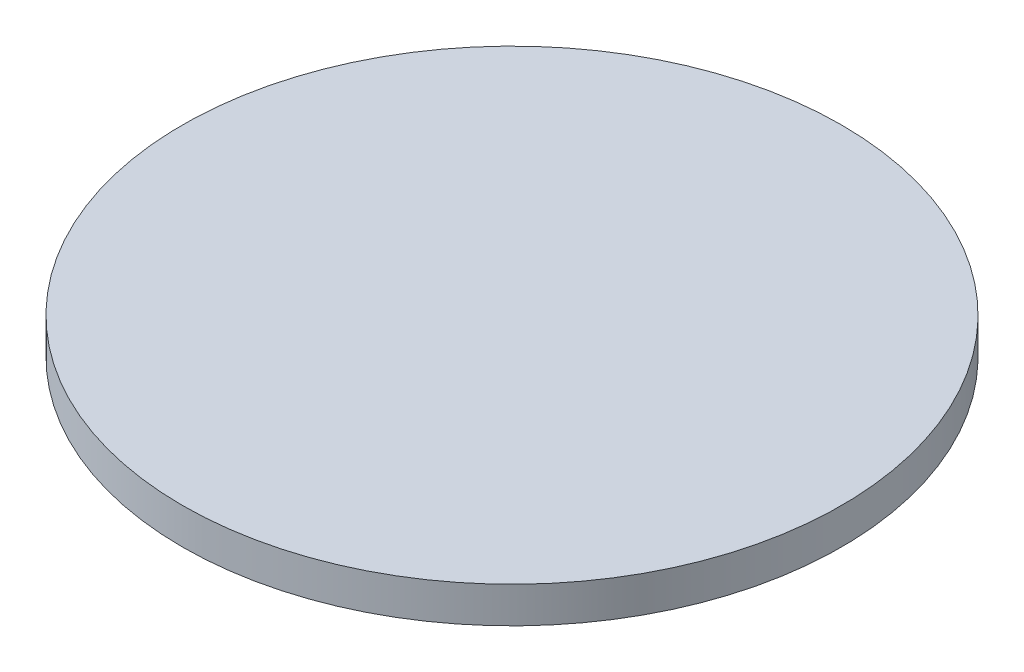
ISO-10303-21;
HEADER;
FILE_DESCRIPTION(('STEP AP214'),'2;1');
FILE_NAME('part.step','',(''),(''),'','','');
FILE_SCHEMA(('AUTOMOTIVE_DESIGN { 1 0 10303 214 1 1 1 1 }'));
ENDSEC;
DATA;
#1=APPLICATION_CONTEXT('core data for automotive mechanical design processes');
#2=APPLICATION_PROTOCOL_DEFINITION('international standard','automotive_design',2000,#1);
#3=PRODUCT_CONTEXT('',#1,'mechanical');
#4=PRODUCT('Part','Part','',(#3));
#5=PRODUCT_RELATED_PRODUCT_CATEGORY('part','',(#4));
#6=PRODUCT_DEFINITION_FORMATION('','',#4);
#7=PRODUCT_DEFINITION_CONTEXT('part definition',#1,'design');
#8=PRODUCT_DEFINITION('design','',#6,#7);
#9=PRODUCT_DEFINITION_SHAPE('','',#8);
#10=(LENGTH_UNIT() NAMED_UNIT(*) SI_UNIT(.MILLI.,.METRE.));
#11=(NAMED_UNIT(*) PLANE_ANGLE_UNIT() SI_UNIT($,.RADIAN.));
#12=(NAMED_UNIT(*) SI_UNIT($,.STERADIAN.) SOLID_ANGLE_UNIT());
#13=UNCERTAINTY_MEASURE_WITH_UNIT(LENGTH_MEASURE(1.E-05),#10,'distance_accuracy_value','');
#14=(GEOMETRIC_REPRESENTATION_CONTEXT(3) GLOBAL_UNCERTAINTY_ASSIGNED_CONTEXT((#13)) GLOBAL_UNIT_ASSIGNED_CONTEXT((#10,
#11,#12)) REPRESENTATION_CONTEXT('',''));
#15=CARTESIAN_POINT('',(0.,0.,0.));
#16=DIRECTION('',(0.,0.,1.));
#17=DIRECTION('',(1.,0.,0.));
#18=AXIS2_PLACEMENT_3D('',#15,#16,#17);
#19=CARTESIAN_POINT('',(0.,7.,0.));
#20=DIRECTION('',(0.,-1.,0.));
#21=DIRECTION('',(0.,0.,-1.));
#22=AXIS2_PLACEMENT_3D('',#19,#20,#21);
#23=CYLINDRICAL_SURFACE('',#22,64.);
#24=CARTESIAN_POINT('',(0.,7.,0.));
#25=DIRECTION('',(0.,1.,0.));
#26=DIRECTION('',(0.,0.,1.));
#27=AXIS2_PLACEMENT_3D('',#24,#25,#26);
#28=CIRCLE('',#27,64.);
#29=CARTESIAN_POINT('',(0.,7.,64.));
#30=VERTEX_POINT('',#29);
#31=EDGE_CURVE('E10',#30,#30,#28,.T.);
#32=ORIENTED_EDGE('',*,*,#31,.F.);
#33=EDGE_LOOP('',(#32));
#34=FACE_BOUND('',#33,.T.);
#35=CARTESIAN_POINT('',(0.,0.,0.));
#36=DIRECTION('',(0.,1.,0.));
#37=DIRECTION('',(0.,0.,1.));
#38=AXIS2_PLACEMENT_3D('',#35,#36,#37);
#39=CIRCLE('',#38,64.);
#40=CARTESIAN_POINT('',(0.,0.,64.));
#41=VERTEX_POINT('',#40);
#42=EDGE_CURVE('E40',#41,#41,#39,.T.);
#43=ORIENTED_EDGE('',*,*,#42,.T.);
#44=EDGE_LOOP('',(#43));
#45=FACE_BOUND('',#44,.T.);
#46=ADVANCED_FACE('F37',(#34,#45),#23,.T.);
#47=CARTESIAN_POINT('',(0.,7.,0.));
#48=DIRECTION('',(0.,1.,0.));
#49=DIRECTION('',(0.,0.,1.));
#50=AXIS2_PLACEMENT_3D('',#47,#48,#49);
#51=PLANE('',#50);
#52=ORIENTED_EDGE('',*,*,#31,.T.);
#53=EDGE_LOOP('',(#52));
#54=FACE_BOUND('',#53,.T.);
#55=ADVANCED_FACE('F52',(#54),#51,.T.);
#56=CARTESIAN_POINT('',(0.,0.,0.));
#57=DIRECTION('',(0.,1.,0.));
#58=DIRECTION('',(0.,0.,1.));
#59=AXIS2_PLACEMENT_3D('',#56,#57,#58);
#60=PLANE('',#59);
#61=ORIENTED_EDGE('',*,*,#42,.F.);
#62=EDGE_LOOP('',(#61));
#63=FACE_BOUND('',#62,.T.);
#64=ADVANCED_FACE('F50',(#63),#60,.F.);
#65=CLOSED_SHELL('',(#46,#55,#64));
#66=MANIFOLD_SOLID_BREP('B2',#65);
#67=ADVANCED_BREP_SHAPE_REPRESENTATION('',(#18,#66),#14);
#68=SHAPE_DEFINITION_REPRESENTATION(#9,#67);
ENDSEC;
END-ISO-10303-21;
